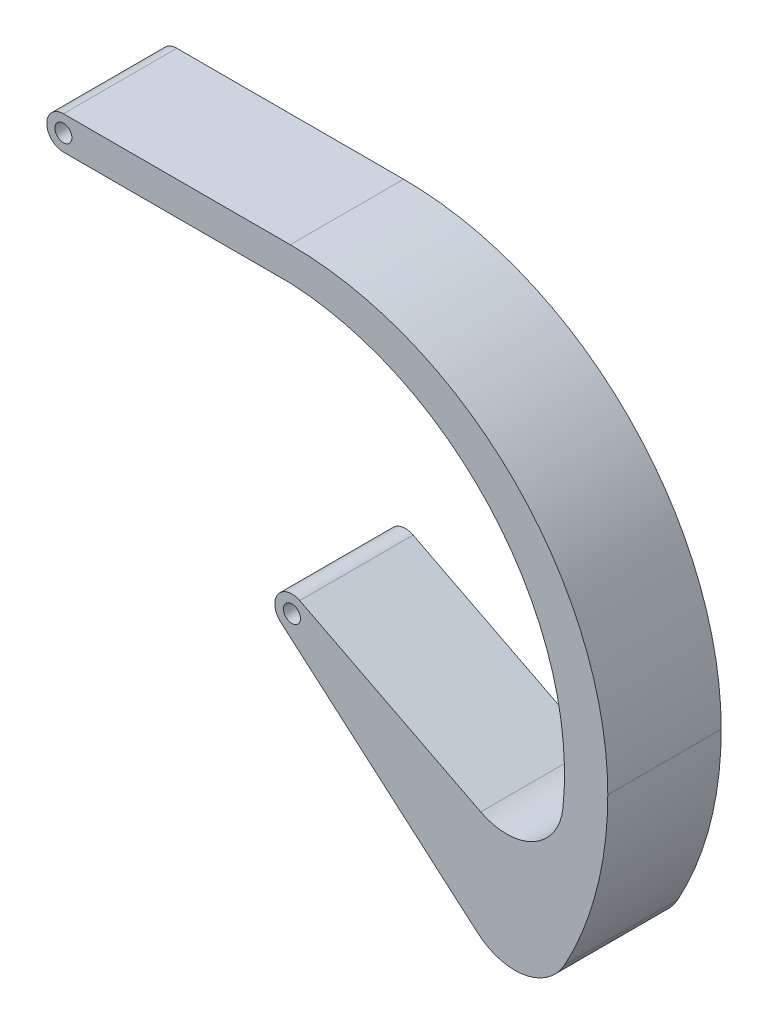
ISO-10303-21;
HEADER;
FILE_DESCRIPTION(('STEP AP214'),'2;1');
FILE_NAME('part.step','',(''),(''),'','','');
FILE_SCHEMA(('AUTOMOTIVE_DESIGN { 1 0 10303 214 1 1 1 1 }'));
ENDSEC;
DATA;
#1=APPLICATION_CONTEXT('core data for automotive mechanical design processes');
#2=APPLICATION_PROTOCOL_DEFINITION('international standard','automotive_design',2000,#1);
#3=PRODUCT_CONTEXT('',#1,'mechanical');
#4=PRODUCT('Part','Part','',(#3));
#5=PRODUCT_RELATED_PRODUCT_CATEGORY('part','',(#4));
#6=PRODUCT_DEFINITION_FORMATION('','',#4);
#7=PRODUCT_DEFINITION_CONTEXT('part definition',#1,'design');
#8=PRODUCT_DEFINITION('design','',#6,#7);
#9=PRODUCT_DEFINITION_SHAPE('','',#8);
#10=(LENGTH_UNIT() NAMED_UNIT(*) SI_UNIT(.MILLI.,.METRE.));
#11=(NAMED_UNIT(*) PLANE_ANGLE_UNIT() SI_UNIT($,.RADIAN.));
#12=(NAMED_UNIT(*) SI_UNIT($,.STERADIAN.) SOLID_ANGLE_UNIT());
#13=UNCERTAINTY_MEASURE_WITH_UNIT(LENGTH_MEASURE(1.E-05),#10,'distance_accuracy_value','');
#14=(GEOMETRIC_REPRESENTATION_CONTEXT(3) GLOBAL_UNCERTAINTY_ASSIGNED_CONTEXT((#13)) GLOBAL_UNIT_ASSIGNED_CONTEXT((#10,
#11,#12)) REPRESENTATION_CONTEXT('',''));
#15=CARTESIAN_POINT('',(0.,0.,0.));
#16=DIRECTION('',(0.,0.,1.));
#17=DIRECTION('',(1.,0.,0.));
#18=AXIS2_PLACEMENT_3D('',#15,#16,#17);
#19=CARTESIAN_POINT('',(-60.5112986354165,39.0361159832423,11.));
#20=DIRECTION('',(0.,0.,-1.));
#21=DIRECTION('',(-1.,0.,0.));
#22=AXIS2_PLACEMENT_3D('',#19,#20,#21);
#23=CYLINDRICAL_SURFACE('',#22,2.92868442736668);
#24=CARTESIAN_POINT('',(-60.5112986354165,39.0361159832423,-9.));
#25=DIRECTION('',(0.,0.,1.));
#26=DIRECTION('',(1.,0.,0.));
#27=AXIS2_PLACEMENT_3D('',#24,#25,#26);
#28=CIRCLE('',#27,2.92868442736668);
#29=CARTESIAN_POINT('',(-60.5112986354165,41.964800410609,-9.));
#30=VERTEX_POINT('',#29);
#31=CARTESIAN_POINT('',(-60.5112986354165,36.1074315558756,-9.));
#32=VERTEX_POINT('',#31);
#33=EDGE_CURVE('E146',#30,#32,#28,.T.);
#34=ORIENTED_EDGE('',*,*,#33,.T.);
#35=DIRECTION('',(0.,0.,-1.));
#36=VECTOR('',#35,1.);
#37=CARTESIAN_POINT('',(-60.5112986354165,36.1074315558756,11.));
#38=LINE('',#37,#36);
#39=CARTESIAN_POINT('',(-60.5112986354165,36.1074315558756,11.));
#40=VERTEX_POINT('',#39);
#41=EDGE_CURVE('E127',#40,#32,#38,.T.);
#42=ORIENTED_EDGE('',*,*,#41,.F.);
#43=CARTESIAN_POINT('',(-60.5112986354165,39.0361159832423,11.));
#44=DIRECTION('',(0.,0.,1.));
#45=DIRECTION('',(1.,0.,0.));
#46=AXIS2_PLACEMENT_3D('',#43,#44,#45);
#47=CIRCLE('',#46,2.92868442736668);
#48=CARTESIAN_POINT('',(-60.5112986354165,41.964800410609,11.));
#49=VERTEX_POINT('',#48);
#50=EDGE_CURVE('E133',#49,#40,#47,.T.);
#51=ORIENTED_EDGE('',*,*,#50,.F.);
#52=DIRECTION('',(0.,0.,-1.));
#53=VECTOR('',#52,1.);
#54=CARTESIAN_POINT('',(-60.5112986354165,41.964800410609,11.));
#55=LINE('',#54,#53);
#56=EDGE_CURVE('E187',#49,#30,#55,.T.);
#57=ORIENTED_EDGE('',*,*,#56,.T.);
#58=EDGE_LOOP('',(#34,#42,#51,#57));
#59=FACE_BOUND('',#58,.T.);
#60=ADVANCED_FACE('F39',(#59),#23,.T.);
#61=CARTESIAN_POINT('',(-60.5112986354165,36.1074315558756,11.));
#62=DIRECTION('',(0.,1.,0.));
#63=DIRECTION('',(0.,0.,1.));
#64=AXIS2_PLACEMENT_3D('',#61,#62,#63);
#65=PLANE('',#64);
#66=DIRECTION('',(1.,0.,0.));
#67=VECTOR('',#66,1.);
#68=CARTESIAN_POINT('',(-60.5112986354165,36.1074315558756,-9.));
#69=LINE('',#68,#67);
#70=CARTESIAN_POINT('',(-20.5112986354165,36.1074315558756,-9.));
#71=VERTEX_POINT('',#70);
#72=EDGE_CURVE('E176',#32,#71,#69,.T.);
#73=ORIENTED_EDGE('',*,*,#72,.T.);
#74=DIRECTION('',(0.,0.,-1.));
#75=VECTOR('',#74,1.);
#76=CARTESIAN_POINT('',(-20.5112986354165,36.1074315558756,11.));
#77=LINE('',#76,#75);
#78=CARTESIAN_POINT('',(-20.5112986354165,36.1074315558756,11.));
#79=VERTEX_POINT('',#78);
#80=EDGE_CURVE('E130',#79,#71,#77,.T.);
#81=ORIENTED_EDGE('',*,*,#80,.F.);
#82=DIRECTION('',(1.,0.,0.));
#83=VECTOR('',#82,1.);
#84=CARTESIAN_POINT('',(-60.5112986354165,36.1074315558756,11.));
#85=LINE('',#84,#83);
#86=EDGE_CURVE('E123',#40,#79,#85,.T.);
#87=ORIENTED_EDGE('',*,*,#86,.F.);
#88=ORIENTED_EDGE('',*,*,#41,.T.);
#89=EDGE_LOOP('',(#73,#81,#87,#88));
#90=FACE_BOUND('',#89,.T.);
#91=ADVANCED_FACE('F125',(#90),#65,.F.);
#92=CARTESIAN_POINT('',(-22.987709000895,-14.6763129436273,11.));
#93=DIRECTION('',(0.,0.,-1.));
#94=DIRECTION('',(-1.,0.,0.));
#95=AXIS2_PLACEMENT_3D('',#92,#93,#94);
#96=CYLINDRICAL_SURFACE('',#95,50.8440882865358);
#97=CARTESIAN_POINT('',(-22.987709000895,-14.6763129436273,-9.));
#98=DIRECTION('',(0.,0.,-1.));
#99=DIRECTION('',(-1.,0.,0.));
#100=AXIS2_PLACEMENT_3D('',#97,#98,#99);
#101=CIRCLE('',#100,50.8440882865358);
#102=CARTESIAN_POINT('',(27.5759397198617,-20.0091116209603,-9.));
#103=VERTEX_POINT('',#102);
#104=EDGE_CURVE('E169',#71,#103,#101,.T.);
#105=ORIENTED_EDGE('',*,*,#104,.T.);
#106=DIRECTION('',(0.,0.,-1.));
#107=VECTOR('',#106,1.);
#108=CARTESIAN_POINT('',(27.5759397198617,-20.0091116209603,11.));
#109=LINE('',#108,#107);
#110=CARTESIAN_POINT('',(27.5759397198617,-20.0091116209603,11.));
#111=VERTEX_POINT('',#110);
#112=EDGE_CURVE('E54',#103,#111,#109,.F.);
#113=ORIENTED_EDGE('',*,*,#112,.T.);
#114=CARTESIAN_POINT('',(-22.987709000895,-14.6763129436273,11.));
#115=DIRECTION('',(0.,0.,-1.));
#116=DIRECTION('',(-1.,0.,0.));
#117=AXIS2_PLACEMENT_3D('',#114,#115,#116);
#118=CIRCLE('',#117,50.8440882865358);
#119=EDGE_CURVE('E132',#79,#111,#118,.T.);
#120=ORIENTED_EDGE('',*,*,#119,.F.);
#121=ORIENTED_EDGE('',*,*,#80,.T.);
#122=EDGE_LOOP('',(#105,#113,#120,#121));
#123=FACE_BOUND('',#122,.T.);
#124=ADVANCED_FACE('F230',(#123),#96,.F.);
#125=CARTESIAN_POINT('',(-18.8342243705154,-11.5477466933533,11.));
#126=DIRECTION('',(-0.455225001384209,-0.890376436185699,0.));
#127=DIRECTION('',(0.890376436185699,-0.455225001384209,0.));
#128=AXIS2_PLACEMENT_3D('',#125,#126,#127);
#129=PLANE('',#128);
#130=DIRECTION('',(-0.890376436185699,0.455225001384209,0.));
#131=VECTOR('',#130,1.);
#132=CARTESIAN_POINT('',(-18.8342243705154,-11.5477466933533,11.));
#133=LINE('',#132,#131);
#134=CARTESIAN_POINT('',(13.0788464755143,-27.8640227420473,11.));
#135=VERTEX_POINT('',#134);
#136=CARTESIAN_POINT('',(-18.8342243705154,-11.5477466933533,11.));
#137=VERTEX_POINT('',#136);
#138=EDGE_CURVE('E232',#135,#137,#133,.T.);
#139=ORIENTED_EDGE('',*,*,#138,.F.);
#140=DIRECTION('',(0.,0.,1.));
#141=VECTOR('',#140,1.);
#142=CARTESIAN_POINT('',(13.0788464755143,-27.8640227420473,-9.));
#143=LINE('',#142,#141);
#144=CARTESIAN_POINT('',(13.0788464755143,-27.8640227420473,-9.));
#145=VERTEX_POINT('',#144);
#146=EDGE_CURVE('E161',#135,#145,#143,.F.);
#147=ORIENTED_EDGE('',*,*,#146,.T.);
#148=DIRECTION('',(-0.890376436185699,0.455225001384209,0.));
#149=VECTOR('',#148,1.);
#150=CARTESIAN_POINT('',(-18.8342243705154,-11.5477466933533,-9.));
#151=LINE('',#150,#149);
#152=CARTESIAN_POINT('',(-18.8342243705154,-11.5477466933533,-9.));
#153=VERTEX_POINT('',#152);
#154=EDGE_CURVE('E167',#145,#153,#151,.T.);
#155=ORIENTED_EDGE('',*,*,#154,.T.);
#156=DIRECTION('',(0.,0.,-1.));
#157=VECTOR('',#156,1.);
#158=CARTESIAN_POINT('',(-18.8342243705154,-11.5477466933533,11.));
#159=LINE('',#158,#157);
#160=EDGE_CURVE('E152',#137,#153,#159,.T.);
#161=ORIENTED_EDGE('',*,*,#160,.F.);
#162=EDGE_LOOP('',(#139,#147,#155,#161));
#163=FACE_BOUND('',#162,.T.);
#164=ADVANCED_FACE('F236',(#163),#129,.F.);
#165=CARTESIAN_POINT('',(-20.209888725008,-14.2384142129674,11.));
#166=DIRECTION('',(0.,0.,-1.));
#167=DIRECTION('',(-1.,0.,0.));
#168=AXIS2_PLACEMENT_3D('',#165,#166,#167);
#169=CYLINDRICAL_SURFACE('',#168,3.02194376475271);
#170=CARTESIAN_POINT('',(-20.209888725008,-14.2384142129674,-9.));
#171=DIRECTION('',(0.,0.,1.));
#172=DIRECTION('',(-1.,0.,0.));
#173=AXIS2_PLACEMENT_3D('',#170,#171,#172);
#174=CIRCLE('',#173,3.02194376475271);
#175=CARTESIAN_POINT('',(-22.1883729003176,-16.5226524854288,-9.));
#176=VERTEX_POINT('',#175);
#177=EDGE_CURVE('E168',#153,#176,#174,.T.);
#178=ORIENTED_EDGE('',*,*,#177,.T.);
#179=DIRECTION('',(0.,0.,-1.));
#180=VECTOR('',#179,1.);
#181=CARTESIAN_POINT('',(-22.1883729003176,-16.5226524854288,11.));
#182=LINE('',#181,#180);
#183=CARTESIAN_POINT('',(-22.1883729003176,-16.5226524854288,11.));
#184=VERTEX_POINT('',#183);
#185=EDGE_CURVE('E195',#184,#176,#182,.T.);
#186=ORIENTED_EDGE('',*,*,#185,.F.);
#187=CARTESIAN_POINT('',(-20.209888725008,-14.2384142129674,11.));
#188=DIRECTION('',(0.,0.,1.));
#189=DIRECTION('',(-1.,0.,0.));
#190=AXIS2_PLACEMENT_3D('',#187,#188,#189);
#191=CIRCLE('',#190,3.02194376475271);
#192=EDGE_CURVE('E202',#137,#184,#191,.T.);
#193=ORIENTED_EDGE('',*,*,#192,.F.);
#194=ORIENTED_EDGE('',*,*,#160,.T.);
#195=EDGE_LOOP('',(#178,#186,#193,#194));
#196=FACE_BOUND('',#195,.T.);
#197=ADVANCED_FACE('F200',(#196),#169,.T.);
#198=CARTESIAN_POINT('',(-22.1883729003176,-16.5226524854288,11.));
#199=DIRECTION('',(0.654705821592788,0.755883778879076,0.));
#200=DIRECTION('',(-0.755883778879076,0.654705821592788,0.));
#201=AXIS2_PLACEMENT_3D('',#198,#199,#200);
#202=PLANE('',#201);
#203=DIRECTION('',(0.755883778879076,-0.654705821592788,0.));
#204=VECTOR('',#203,1.);
#205=CARTESIAN_POINT('',(-22.1883729003176,-16.5226524854288,-9.));
#206=LINE('',#205,#204);
#207=CARTESIAN_POINT('',(12.5384153290408,-46.6011262591305,-9.));
#208=VERTEX_POINT('',#207);
#209=EDGE_CURVE('E174',#176,#208,#206,.T.);
#210=ORIENTED_EDGE('',*,*,#209,.T.);
#211=DIRECTION('',(0.,0.,-1.));
#212=VECTOR('',#211,1.);
#213=CARTESIAN_POINT('',(12.5384153290408,-46.6011262591305,11.));
#214=LINE('',#213,#212);
#215=CARTESIAN_POINT('',(12.5384153290408,-46.6011262591305,11.));
#216=VERTEX_POINT('',#215);
#217=EDGE_CURVE('E157',#208,#216,#214,.F.);
#218=ORIENTED_EDGE('',*,*,#217,.T.);
#219=DIRECTION('',(0.755883778879076,-0.654705821592788,0.));
#220=VECTOR('',#219,1.);
#221=CARTESIAN_POINT('',(-22.1883729003176,-16.5226524854288,11.));
#222=LINE('',#221,#220);
#223=EDGE_CURVE('E218',#184,#216,#222,.T.);
#224=ORIENTED_EDGE('',*,*,#223,.F.);
#225=ORIENTED_EDGE('',*,*,#185,.T.);
#226=EDGE_LOOP('',(#210,#218,#224,#225));
#227=FACE_BOUND('',#226,.T.);
#228=ADVANCED_FACE('F209',(#227),#202,.F.);
#229=CARTESIAN_POINT('',(-26.5441045562311,-14.035199589391,11.));
#230=DIRECTION('',(0.,0.,-1.));
#231=DIRECTION('',(-1.,0.,0.));
#232=AXIS2_PLACEMENT_3D('',#229,#230,#231);
#233=CYLINDRICAL_SURFACE('',#232,62.0328059208146);
#234=CARTESIAN_POINT('',(-26.5441045562311,-14.035199589391,11.));
#235=DIRECTION('',(0.,0.,1.));
#236=DIRECTION('',(-1.,0.,0.));
#237=AXIS2_PLACEMENT_3D('',#234,#235,#236);
#238=CIRCLE('',#237,62.0328059208146);
#239=CARTESIAN_POINT('',(27.8548599529668,-43.8483119853901,11.));
#240=VERTEX_POINT('',#239);
#241=CARTESIAN_POINT('',(35.4887013645835,-14.0351995893912,11.));
#242=VERTEX_POINT('',#241);
#243=EDGE_CURVE('E216',#240,#242,#238,.T.);
#244=ORIENTED_EDGE('',*,*,#243,.F.);
#245=DIRECTION('',(0.,0.,-1.));
#246=VECTOR('',#245,1.);
#247=CARTESIAN_POINT('',(27.8548599529668,-43.8483119853901,11.));
#248=LINE('',#247,#246);
#249=CARTESIAN_POINT('',(27.8548599529668,-43.8483119853901,-9.));
#250=VERTEX_POINT('',#249);
#251=EDGE_CURVE('E147',#240,#250,#248,.T.);
#252=ORIENTED_EDGE('',*,*,#251,.T.);
#253=CARTESIAN_POINT('',(-26.5441045562311,-14.035199589391,-9.));
#254=DIRECTION('',(0.,0.,1.));
#255=DIRECTION('',(-1.,0.,0.));
#256=AXIS2_PLACEMENT_3D('',#253,#254,#255);
#257=CIRCLE('',#256,62.0328059208146);
#258=CARTESIAN_POINT('',(35.4887013645835,-14.0351995893912,-9.));
#259=VERTEX_POINT('',#258);
#260=EDGE_CURVE('E182',#250,#259,#257,.T.);
#261=ORIENTED_EDGE('',*,*,#260,.T.);
#262=DIRECTION('',(0.,0.,-1.));
#263=VECTOR('',#262,1.);
#264=CARTESIAN_POINT('',(35.4887013645835,-14.0351995893912,11.));
#265=LINE('',#264,#263);
#266=EDGE_CURVE('E192',#242,#259,#265,.T.);
#267=ORIENTED_EDGE('',*,*,#266,.F.);
#268=EDGE_LOOP('',(#244,#252,#261,#267));
#269=FACE_BOUND('',#268,.T.);
#270=ADVANCED_FACE('F220',(#269),#233,.T.);
#271=CARTESIAN_POINT('',(-20.5112986354165,-14.035199589391,11.));
#272=DIRECTION('',(0.,0.,-1.));
#273=DIRECTION('',(-1.,0.,0.));
#274=AXIS2_PLACEMENT_3D('',#271,#272,#273);
#275=CYLINDRICAL_SURFACE('',#274,56.);
#276=CARTESIAN_POINT('',(-20.5112986354165,-14.035199589391,-9.));
#277=DIRECTION('',(0.,0.,1.));
#278=DIRECTION('',(-1.,0.,0.));
#279=AXIS2_PLACEMENT_3D('',#276,#277,#278);
#280=CIRCLE('',#279,56.);
#281=CARTESIAN_POINT('',(-20.5112986354165,41.964800410609,-9.));
#282=VERTEX_POINT('',#281);
#283=EDGE_CURVE('E184',#259,#282,#280,.T.);
#284=ORIENTED_EDGE('',*,*,#283,.T.);
#285=DIRECTION('',(0.,0.,-1.));
#286=VECTOR('',#285,1.);
#287=CARTESIAN_POINT('',(-20.5112986354165,41.964800410609,11.));
#288=LINE('',#287,#286);
#289=CARTESIAN_POINT('',(-20.5112986354165,41.964800410609,11.));
#290=VERTEX_POINT('',#289);
#291=EDGE_CURVE('E189',#290,#282,#288,.T.);
#292=ORIENTED_EDGE('',*,*,#291,.F.);
#293=CARTESIAN_POINT('',(-20.5112986354165,-14.035199589391,11.));
#294=DIRECTION('',(0.,0.,1.));
#295=DIRECTION('',(-1.,0.,0.));
#296=AXIS2_PLACEMENT_3D('',#293,#294,#295);
#297=CIRCLE('',#296,56.);
#298=EDGE_CURVE('E222',#242,#290,#297,.T.);
#299=ORIENTED_EDGE('',*,*,#298,.F.);
#300=ORIENTED_EDGE('',*,*,#266,.T.);
#301=EDGE_LOOP('',(#284,#292,#299,#300));
#302=FACE_BOUND('',#301,.T.);
#303=ADVANCED_FACE('F260',(#302),#275,.T.);
#304=CARTESIAN_POINT('',(-60.5112986354165,41.964800410609,11.));
#305=DIRECTION('',(0.,-1.,0.));
#306=DIRECTION('',(0.,0.,-1.));
#307=AXIS2_PLACEMENT_3D('',#304,#305,#306);
#308=PLANE('',#307);
#309=DIRECTION('',(-1.,0.,0.));
#310=VECTOR('',#309,1.);
#311=CARTESIAN_POINT('',(-60.5112986354165,41.964800410609,-9.));
#312=LINE('',#311,#310);
#313=EDGE_CURVE('E143',#282,#30,#312,.T.);
#314=ORIENTED_EDGE('',*,*,#313,.T.);
#315=ORIENTED_EDGE('',*,*,#56,.F.);
#316=DIRECTION('',(-1.,0.,0.));
#317=VECTOR('',#316,1.);
#318=CARTESIAN_POINT('',(-60.5112986354165,41.964800410609,11.));
#319=LINE('',#318,#317);
#320=EDGE_CURVE('E139',#290,#49,#319,.T.);
#321=ORIENTED_EDGE('',*,*,#320,.F.);
#322=ORIENTED_EDGE('',*,*,#291,.T.);
#323=EDGE_LOOP('',(#314,#315,#321,#322));
#324=FACE_BOUND('',#323,.T.);
#325=ADVANCED_FACE('F263',(#324),#308,.F.);
#326=CARTESIAN_POINT('',(-60.5112986354165,39.0361159832423,11.));
#327=DIRECTION('',(0.,0.,1.));
#328=DIRECTION('',(1.,0.,0.));
#329=AXIS2_PLACEMENT_3D('',#326,#327,#328);
#330=PLANE('',#329);
#331=CARTESIAN_POINT('',(-60.5112986354165,39.0361159832423,11.));
#332=DIRECTION('',(0.,0.,-1.));
#333=DIRECTION('',(-1.,0.,0.));
#334=AXIS2_PLACEMENT_3D('',#331,#332,#333);
#335=CIRCLE('',#334,1.5);
#336=CARTESIAN_POINT('',(-62.0112986354165,39.0361159832423,11.));
#337=VERTEX_POINT('',#336);
#338=EDGE_CURVE('E285',#337,#337,#335,.T.);
#339=ORIENTED_EDGE('',*,*,#338,.T.);
#340=EDGE_LOOP('',(#339));
#341=FACE_BOUND('',#340,.T.);
#342=CARTESIAN_POINT('',(-20.209888725008,-14.2384142129674,11.));
#343=DIRECTION('',(0.,0.,-1.));
#344=DIRECTION('',(-1.,0.,0.));
#345=AXIS2_PLACEMENT_3D('',#342,#343,#344);
#346=CIRCLE('',#345,1.5);
#347=CARTESIAN_POINT('',(-21.709888725008,-14.2384142129674,11.));
#348=VERTEX_POINT('',#347);
#349=EDGE_CURVE('E229',#348,#348,#346,.T.);
#350=ORIENTED_EDGE('',*,*,#349,.T.);
#351=EDGE_LOOP('',(#350));
#352=FACE_BOUND('',#351,.T.);
#353=ORIENTED_EDGE('',*,*,#223,.T.);
#354=CARTESIAN_POINT('',(19.0854735449687,-39.0422884703397,11.));
#355=DIRECTION('',(0.,0.,1.));
#356=DIRECTION('',(1.,0.,0.));
#357=AXIS2_PLACEMENT_3D('',#354,#355,#356);
#358=CIRCLE('',#357,10.);
#359=EDGE_CURVE('E159',#216,#240,#358,.T.);
#360=ORIENTED_EDGE('',*,*,#359,.T.);
#361=ORIENTED_EDGE('',*,*,#243,.T.);
#362=ORIENTED_EDGE('',*,*,#298,.T.);
#363=ORIENTED_EDGE('',*,*,#320,.T.);
#364=ORIENTED_EDGE('',*,*,#50,.T.);
#365=ORIENTED_EDGE('',*,*,#86,.T.);
#366=ORIENTED_EDGE('',*,*,#119,.T.);
#367=CARTESIAN_POINT('',(17.6310964893564,-18.9602583801903,11.));
#368=DIRECTION('',(0.,0.,1.));
#369=DIRECTION('',(1.,0.,0.));
#370=AXIS2_PLACEMENT_3D('',#367,#368,#369);
#371=CIRCLE('',#370,10.);
#372=EDGE_CURVE('E11',#111,#135,#371,.F.);
#373=ORIENTED_EDGE('',*,*,#372,.T.);
#374=ORIENTED_EDGE('',*,*,#138,.T.);
#375=ORIENTED_EDGE('',*,*,#192,.T.);
#376=EDGE_LOOP('',(#353,#360,#361,#362,#363,#364,#365,#366,#373,#374,#375));
#377=FACE_BOUND('',#376,.T.);
#378=ADVANCED_FACE('F137',(#341,#352,#377),#330,.T.);
#379=CARTESIAN_POINT('',(-60.5112986354165,39.0361159832423,-9.));
#380=DIRECTION('',(0.,0.,1.));
#381=DIRECTION('',(1.,0.,0.));
#382=AXIS2_PLACEMENT_3D('',#379,#380,#381);
#383=PLANE('',#382);
#384=CARTESIAN_POINT('',(-60.5112986354165,39.0361159832423,-9.));
#385=DIRECTION('',(0.,0.,-1.));
#386=DIRECTION('',(-1.,0.,0.));
#387=AXIS2_PLACEMENT_3D('',#384,#385,#386);
#388=CIRCLE('',#387,1.5);
#389=CARTESIAN_POINT('',(-62.0112986354165,39.0361159832423,-9.));
#390=VERTEX_POINT('',#389);
#391=EDGE_CURVE('E288',#390,#390,#388,.T.);
#392=ORIENTED_EDGE('',*,*,#391,.F.);
#393=EDGE_LOOP('',(#392));
#394=FACE_BOUND('',#393,.T.);
#395=CARTESIAN_POINT('',(-20.209888725008,-14.2384142129674,-9.));
#396=DIRECTION('',(0.,0.,-1.));
#397=DIRECTION('',(-1.,0.,0.));
#398=AXIS2_PLACEMENT_3D('',#395,#396,#397);
#399=CIRCLE('',#398,1.5);
#400=CARTESIAN_POINT('',(-21.709888725008,-14.2384142129674,-9.));
#401=VERTEX_POINT('',#400);
#402=EDGE_CURVE('E290',#401,#401,#399,.T.);
#403=ORIENTED_EDGE('',*,*,#402,.F.);
#404=EDGE_LOOP('',(#403));
#405=FACE_BOUND('',#404,.T.);
#406=ORIENTED_EDGE('',*,*,#260,.F.);
#407=CARTESIAN_POINT('',(19.0854735449687,-39.0422884703397,-9.));
#408=DIRECTION('',(0.,0.,1.));
#409=DIRECTION('',(1.,0.,0.));
#410=AXIS2_PLACEMENT_3D('',#407,#408,#409);
#411=CIRCLE('',#410,10.);
#412=EDGE_CURVE('E150',#250,#208,#411,.F.);
#413=ORIENTED_EDGE('',*,*,#412,.T.);
#414=ORIENTED_EDGE('',*,*,#209,.F.);
#415=ORIENTED_EDGE('',*,*,#177,.F.);
#416=ORIENTED_EDGE('',*,*,#154,.F.);
#417=CARTESIAN_POINT('',(17.6310964893564,-18.9602583801903,-9.));
#418=DIRECTION('',(0.,0.,1.));
#419=DIRECTION('',(1.,0.,0.));
#420=AXIS2_PLACEMENT_3D('',#417,#418,#419);
#421=CIRCLE('',#420,10.);
#422=EDGE_CURVE('E47',#145,#103,#421,.T.);
#423=ORIENTED_EDGE('',*,*,#422,.T.);
#424=ORIENTED_EDGE('',*,*,#104,.F.);
#425=ORIENTED_EDGE('',*,*,#72,.F.);
#426=ORIENTED_EDGE('',*,*,#33,.F.);
#427=ORIENTED_EDGE('',*,*,#313,.F.);
#428=ORIENTED_EDGE('',*,*,#283,.F.);
#429=EDGE_LOOP('',(#406,#413,#414,#415,#416,#423,#424,#425,#426,#427,#428));
#430=FACE_BOUND('',#429,.T.);
#431=ADVANCED_FACE('F206',(#394,#405,#430),#383,.F.);
#432=CARTESIAN_POINT('',(-20.209888725008,-14.2384142129674,11.));
#433=DIRECTION('',(0.,0.,-1.));
#434=DIRECTION('',(-1.,0.,0.));
#435=AXIS2_PLACEMENT_3D('',#432,#433,#434);
#436=CYLINDRICAL_SURFACE('',#435,1.5);
#437=ORIENTED_EDGE('',*,*,#349,.F.);
#438=EDGE_LOOP('',(#437));
#439=FACE_BOUND('',#438,.T.);
#440=ORIENTED_EDGE('',*,*,#402,.T.);
#441=EDGE_LOOP('',(#440));
#442=FACE_BOUND('',#441,.T.);
#443=ADVANCED_FACE('F270',(#439,#442),#436,.F.);
#444=CARTESIAN_POINT('',(-60.5112986354165,39.0361159832423,11.));
#445=DIRECTION('',(0.,0.,-1.));
#446=DIRECTION('',(-1.,0.,0.));
#447=AXIS2_PLACEMENT_3D('',#444,#445,#446);
#448=CYLINDRICAL_SURFACE('',#447,1.5);
#449=ORIENTED_EDGE('',*,*,#338,.F.);
#450=EDGE_LOOP('',(#449));
#451=FACE_BOUND('',#450,.T.);
#452=ORIENTED_EDGE('',*,*,#391,.T.);
#453=EDGE_LOOP('',(#452));
#454=FACE_BOUND('',#453,.T.);
#455=ADVANCED_FACE('F242',(#451,#454),#448,.F.);
#456=CARTESIAN_POINT('',(19.0854735449687,-39.0422884703397,11.));
#457=DIRECTION('',(0.,0.,-1.));
#458=DIRECTION('',(-1.,0.,0.));
#459=AXIS2_PLACEMENT_3D('',#456,#457,#458);
#460=CYLINDRICAL_SURFACE('',#459,10.);
#461=ORIENTED_EDGE('',*,*,#359,.F.);
#462=ORIENTED_EDGE('',*,*,#217,.F.);
#463=ORIENTED_EDGE('',*,*,#412,.F.);
#464=ORIENTED_EDGE('',*,*,#251,.F.);
#465=EDGE_LOOP('',(#461,#462,#463,#464));
#466=FACE_BOUND('',#465,.T.);
#467=ADVANCED_FACE('F213',(#466),#460,.T.);
#468=CARTESIAN_POINT('',(17.6310964893564,-18.9602583801903,11.));
#469=DIRECTION('',(0.,0.,-1.));
#470=DIRECTION('',(-1.,0.,0.));
#471=AXIS2_PLACEMENT_3D('',#468,#469,#470);
#472=CYLINDRICAL_SURFACE('',#471,10.);
#473=ORIENTED_EDGE('',*,*,#372,.F.);
#474=ORIENTED_EDGE('',*,*,#112,.F.);
#475=ORIENTED_EDGE('',*,*,#422,.F.);
#476=ORIENTED_EDGE('',*,*,#146,.F.);
#477=EDGE_LOOP('',(#473,#474,#475,#476));
#478=FACE_BOUND('',#477,.T.);
#479=ADVANCED_FACE('F41',(#478),#472,.F.);
#480=CLOSED_SHELL('',(#60,#91,#124,#164,#197,#228,#270,#303,#325,#378,#431,#443,#455,#467,#479));
#481=MANIFOLD_SOLID_BREP('B2',#480);
#482=ADVANCED_BREP_SHAPE_REPRESENTATION('',(#18,#481),#14);
#483=SHAPE_DEFINITION_REPRESENTATION(#9,#482);
ENDSEC;
END-ISO-10303-21;
